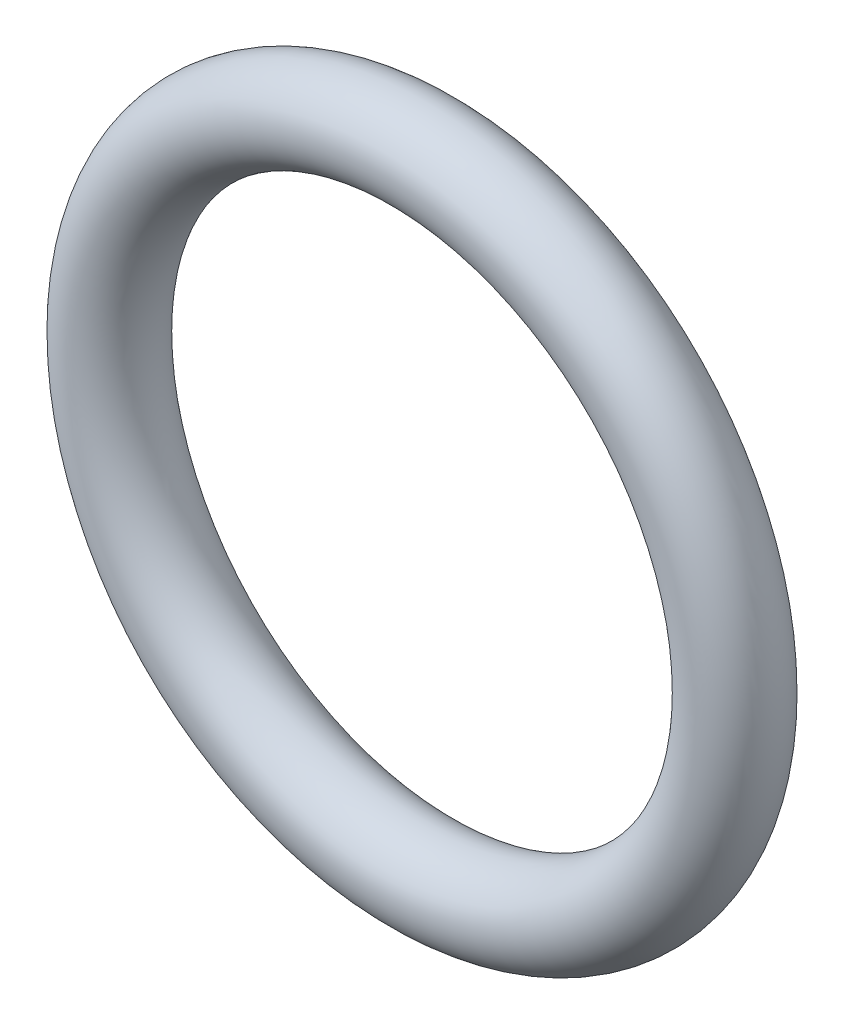
ISO-10303-21;
HEADER;
FILE_DESCRIPTION(('STEP AP214'),'2;1');
FILE_NAME('part.step','',(''),(''),'','','');
FILE_SCHEMA(('AUTOMOTIVE_DESIGN { 1 0 10303 214 1 1 1 1 }'));
ENDSEC;
DATA;
#1=APPLICATION_CONTEXT('core data for automotive mechanical design processes');
#2=APPLICATION_PROTOCOL_DEFINITION('international standard','automotive_design',2000,#1);
#3=PRODUCT_CONTEXT('',#1,'mechanical');
#4=PRODUCT('Part','Part','',(#3));
#5=PRODUCT_RELATED_PRODUCT_CATEGORY('part','',(#4));
#6=PRODUCT_DEFINITION_FORMATION('','',#4);
#7=PRODUCT_DEFINITION_CONTEXT('part definition',#1,'design');
#8=PRODUCT_DEFINITION('design','',#6,#7);
#9=PRODUCT_DEFINITION_SHAPE('','',#8);
#10=(LENGTH_UNIT() NAMED_UNIT(*) SI_UNIT(.MILLI.,.METRE.));
#11=(NAMED_UNIT(*) PLANE_ANGLE_UNIT() SI_UNIT($,.RADIAN.));
#12=(NAMED_UNIT(*) SI_UNIT($,.STERADIAN.) SOLID_ANGLE_UNIT());
#13=UNCERTAINTY_MEASURE_WITH_UNIT(LENGTH_MEASURE(1.E-05),#10,'distance_accuracy_value','');
#14=(GEOMETRIC_REPRESENTATION_CONTEXT(3) GLOBAL_UNCERTAINTY_ASSIGNED_CONTEXT((#13)) GLOBAL_UNIT_ASSIGNED_CONTEXT((#10,
#11,#12)) REPRESENTATION_CONTEXT('',''));
#15=CARTESIAN_POINT('',(0.,0.,0.));
#16=DIRECTION('',(0.,0.,1.));
#17=DIRECTION('',(1.,0.,0.));
#18=AXIS2_PLACEMENT_3D('',#15,#16,#17);
#19=CARTESIAN_POINT('',(0.,0.,0.));
#20=DIRECTION('',(0.,0.,1.));
#21=DIRECTION('',(1.,0.,0.));
#22=AXIS2_PLACEMENT_3D('',#19,#20,#21);
#23=TOROIDAL_SURFACE('',#22,6.2992,0.888999999999998);
#24=CARTESIAN_POINT('',(7.1882,0.,0.));
#25=VERTEX_POINT('',#24);
#26=VERTEX_LOOP('',#25);
#27=FACE_BOUND('',#26,.T.);
#28=ADVANCED_FACE('F39',(#27),#23,.T.);
#29=CLOSED_SHELL('',(#28));
#30=MANIFOLD_SOLID_BREP('B2',#29);
#31=ADVANCED_BREP_SHAPE_REPRESENTATION('',(#18,#30),#14);
#32=SHAPE_DEFINITION_REPRESENTATION(#9,#31);
ENDSEC;
END-ISO-10303-21;
